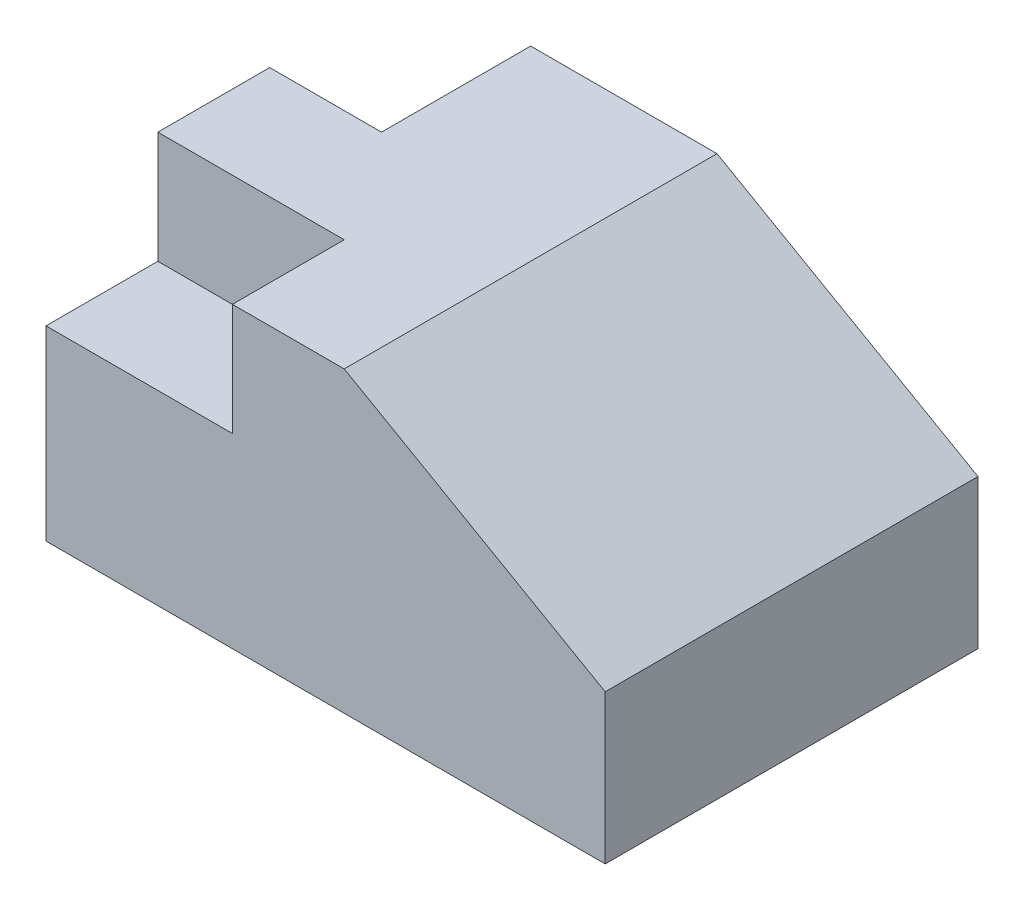
ISO-10303-21;
HEADER;
FILE_DESCRIPTION(('STEP AP214'),'2;1');
FILE_NAME('part.step','',(''),(''),'','','');
FILE_SCHEMA(('AUTOMOTIVE_DESIGN { 1 0 10303 214 1 1 1 1 }'));
ENDSEC;
DATA;
#1=APPLICATION_CONTEXT('core data for automotive mechanical design processes');
#2=APPLICATION_PROTOCOL_DEFINITION('international standard','automotive_design',2000,#1);
#3=PRODUCT_CONTEXT('',#1,'mechanical');
#4=PRODUCT('Part','Part','',(#3));
#5=PRODUCT_RELATED_PRODUCT_CATEGORY('part','',(#4));
#6=PRODUCT_DEFINITION_FORMATION('','',#4);
#7=PRODUCT_DEFINITION_CONTEXT('part definition',#1,'design');
#8=PRODUCT_DEFINITION('design','',#6,#7);
#9=PRODUCT_DEFINITION_SHAPE('','',#8);
#10=(LENGTH_UNIT() NAMED_UNIT(*) SI_UNIT(.MILLI.,.METRE.));
#11=(NAMED_UNIT(*) PLANE_ANGLE_UNIT() SI_UNIT($,.RADIAN.));
#12=(NAMED_UNIT(*) SI_UNIT($,.STERADIAN.) SOLID_ANGLE_UNIT());
#13=UNCERTAINTY_MEASURE_WITH_UNIT(LENGTH_MEASURE(1.E-05),#10,'distance_accuracy_value','');
#14=(GEOMETRIC_REPRESENTATION_CONTEXT(3) GLOBAL_UNCERTAINTY_ASSIGNED_CONTEXT((#13)) GLOBAL_UNIT_ASSIGNED_CONTEXT((#10,
#11,#12)) REPRESENTATION_CONTEXT('',''));
#15=CARTESIAN_POINT('',(0.,0.,0.));
#16=DIRECTION('',(0.,0.,1.));
#17=DIRECTION('',(1.,0.,0.));
#18=AXIS2_PLACEMENT_3D('',#15,#16,#17);
#19=CARTESIAN_POINT('',(75.,80.,50.));
#20=DIRECTION('',(-1.,0.,0.));
#21=DIRECTION('',(0.,0.,1.));
#22=AXIS2_PLACEMENT_3D('',#19,#20,#21);
#23=PLANE('',#22);
#24=DIRECTION('',(0.,-1.,0.));
#25=VECTOR('',#24,1.);
#26=CARTESIAN_POINT('',(75.,80.,-50.));
#27=LINE('',#26,#25);
#28=CARTESIAN_POINT('',(75.,40.,-50.));
#29=VERTEX_POINT('',#28);
#30=CARTESIAN_POINT('',(75.,0.,-50.));
#31=VERTEX_POINT('',#30);
#32=EDGE_CURVE('E11',#29,#31,#27,.T.);
#33=ORIENTED_EDGE('',*,*,#32,.F.);
#34=DIRECTION('',(0.,0.,1.));
#35=VECTOR('',#34,1.);
#36=CARTESIAN_POINT('',(75.,40.,-50.));
#37=LINE('',#36,#35);
#38=CARTESIAN_POINT('',(75.,40.,50.));
#39=VERTEX_POINT('',#38);
#40=EDGE_CURVE('E176',#29,#39,#37,.T.);
#41=ORIENTED_EDGE('',*,*,#40,.T.);
#42=DIRECTION('',(0.,-1.,0.));
#43=VECTOR('',#42,1.);
#44=CARTESIAN_POINT('',(75.,80.,50.));
#45=LINE('',#44,#43);
#46=CARTESIAN_POINT('',(75.,0.,50.));
#47=VERTEX_POINT('',#46);
#48=EDGE_CURVE('E155',#39,#47,#45,.T.);
#49=ORIENTED_EDGE('',*,*,#48,.T.);
#50=DIRECTION('',(0.,0.,-1.));
#51=VECTOR('',#50,1.);
#52=CARTESIAN_POINT('',(75.,0.,50.));
#53=LINE('',#52,#51);
#54=EDGE_CURVE('E172',#47,#31,#53,.T.);
#55=ORIENTED_EDGE('',*,*,#54,.T.);
#56=EDGE_LOOP('',(#33,#41,#49,#55));
#57=FACE_BOUND('',#56,.T.);
#58=ADVANCED_FACE('F43',(#57),#23,.F.);
#59=CARTESIAN_POINT('',(-75.,80.,-50.));
#60=DIRECTION('',(0.,0.,1.));
#61=DIRECTION('',(1.,0.,0.));
#62=AXIS2_PLACEMENT_3D('',#59,#60,#61);
#63=PLANE('',#62);
#64=DIRECTION('',(-1.,0.,0.));
#65=VECTOR('',#64,1.);
#66=CARTESIAN_POINT('',(-75.,50.,-50.));
#67=LINE('',#66,#65);
#68=CARTESIAN_POINT('',(-45.,50.,-50.));
#69=VERTEX_POINT('',#68);
#70=CARTESIAN_POINT('',(-75.,50.,-50.));
#71=VERTEX_POINT('',#70);
#72=EDGE_CURVE('E214',#69,#71,#67,.T.);
#73=ORIENTED_EDGE('',*,*,#72,.F.);
#74=DIRECTION('',(0.,1.,0.));
#75=VECTOR('',#74,1.);
#76=CARTESIAN_POINT('',(-45.,50.,-50.));
#77=LINE('',#76,#75);
#78=CARTESIAN_POINT('',(-45.,80.,-50.));
#79=VERTEX_POINT('',#78);
#80=EDGE_CURVE('E223',#69,#79,#77,.T.);
#81=ORIENTED_EDGE('',*,*,#80,.T.);
#82=DIRECTION('',(-1.,0.,0.));
#83=VECTOR('',#82,1.);
#84=CARTESIAN_POINT('',(-75.,80.,-50.));
#85=LINE('',#84,#83);
#86=CARTESIAN_POINT('',(4.99999999999999,80.,-50.));
#87=VERTEX_POINT('',#86);
#88=EDGE_CURVE('E165',#87,#79,#85,.T.);
#89=ORIENTED_EDGE('',*,*,#88,.F.);
#90=DIRECTION('',(0.868243142124459,-0.496138938356834,0.));
#91=VECTOR('',#90,1.);
#92=CARTESIAN_POINT('',(35.6923076923077,62.4615384615385,-50.));
#93=LINE('',#92,#91);
#94=EDGE_CURVE('E190',#87,#29,#93,.T.);
#95=ORIENTED_EDGE('',*,*,#94,.T.);
#96=ORIENTED_EDGE('',*,*,#32,.T.);
#97=DIRECTION('',(-1.,0.,0.));
#98=VECTOR('',#97,1.);
#99=CARTESIAN_POINT('',(-75.,0.,-50.));
#100=LINE('',#99,#98);
#101=CARTESIAN_POINT('',(-75.,0.,-50.));
#102=VERTEX_POINT('',#101);
#103=EDGE_CURVE('E168',#31,#102,#100,.T.);
#104=ORIENTED_EDGE('',*,*,#103,.T.);
#105=DIRECTION('',(0.,-1.,0.));
#106=VECTOR('',#105,1.);
#107=CARTESIAN_POINT('',(-75.,80.,-50.));
#108=LINE('',#107,#106);
#109=EDGE_CURVE('E51',#71,#102,#108,.T.);
#110=ORIENTED_EDGE('',*,*,#109,.F.);
#111=EDGE_LOOP('',(#73,#81,#89,#95,#96,#104,#110));
#112=FACE_BOUND('',#111,.T.);
#113=ADVANCED_FACE('F263',(#112),#63,.F.);
#114=CARTESIAN_POINT('',(-75.,80.,50.));
#115=DIRECTION('',(1.,0.,0.));
#116=DIRECTION('',(0.,0.,-1.));
#117=AXIS2_PLACEMENT_3D('',#114,#115,#116);
#118=PLANE('',#117);
#119=DIRECTION('',(0.,0.,1.));
#120=VECTOR('',#119,1.);
#121=CARTESIAN_POINT('',(-75.,50.,50.));
#122=LINE('',#121,#120);
#123=CARTESIAN_POINT('',(-75.,50.,20.));
#124=VERTEX_POINT('',#123);
#125=CARTESIAN_POINT('',(-75.,50.,50.));
#126=VERTEX_POINT('',#125);
#127=EDGE_CURVE('E128',#124,#126,#122,.T.);
#128=ORIENTED_EDGE('',*,*,#127,.F.);
#129=DIRECTION('',(0.,1.,0.));
#130=VECTOR('',#129,1.);
#131=CARTESIAN_POINT('',(-75.,50.,20.));
#132=LINE('',#131,#130);
#133=CARTESIAN_POINT('',(-75.,80.,20.));
#134=VERTEX_POINT('',#133);
#135=EDGE_CURVE('E197',#124,#134,#132,.T.);
#136=ORIENTED_EDGE('',*,*,#135,.T.);
#137=DIRECTION('',(0.,0.,1.));
#138=VECTOR('',#137,1.);
#139=CARTESIAN_POINT('',(-75.,80.,50.));
#140=LINE('',#139,#138);
#141=CARTESIAN_POINT('',(-75.,80.,-10.));
#142=VERTEX_POINT('',#141);
#143=EDGE_CURVE('E179',#142,#134,#140,.T.);
#144=ORIENTED_EDGE('',*,*,#143,.F.);
#145=DIRECTION('',(0.,1.,0.));
#146=VECTOR('',#145,1.);
#147=CARTESIAN_POINT('',(-75.,50.,-10.));
#148=LINE('',#147,#146);
#149=CARTESIAN_POINT('',(-75.,50.,-10.));
#150=VERTEX_POINT('',#149);
#151=EDGE_CURVE('E58',#150,#142,#148,.T.);
#152=ORIENTED_EDGE('',*,*,#151,.F.);
#153=DIRECTION('',(0.,0.,1.));
#154=VECTOR('',#153,1.);
#155=CARTESIAN_POINT('',(-75.,50.,-50.));
#156=LINE('',#155,#154);
#157=EDGE_CURVE('E201',#71,#150,#156,.T.);
#158=ORIENTED_EDGE('',*,*,#157,.F.);
#159=ORIENTED_EDGE('',*,*,#109,.T.);
#160=DIRECTION('',(0.,0.,1.));
#161=VECTOR('',#160,1.);
#162=CARTESIAN_POINT('',(-75.,0.,50.));
#163=LINE('',#162,#161);
#164=CARTESIAN_POINT('',(-75.,0.,50.));
#165=VERTEX_POINT('',#164);
#166=EDGE_CURVE('E152',#102,#165,#163,.T.);
#167=ORIENTED_EDGE('',*,*,#166,.T.);
#168=DIRECTION('',(0.,-1.,0.));
#169=VECTOR('',#168,1.);
#170=CARTESIAN_POINT('',(-75.,80.,50.));
#171=LINE('',#170,#169);
#172=EDGE_CURVE('E145',#126,#165,#171,.T.);
#173=ORIENTED_EDGE('',*,*,#172,.F.);
#174=EDGE_LOOP('',(#128,#136,#144,#152,#158,#159,#167,#173));
#175=FACE_BOUND('',#174,.T.);
#176=ADVANCED_FACE('F150',(#175),#118,.F.);
#177=CARTESIAN_POINT('',(-75.,80.,50.));
#178=DIRECTION('',(0.,0.,-1.));
#179=DIRECTION('',(-1.,0.,0.));
#180=AXIS2_PLACEMENT_3D('',#177,#178,#179);
#181=PLANE('',#180);
#182=DIRECTION('',(1.,0.,0.));
#183=VECTOR('',#182,1.);
#184=CARTESIAN_POINT('',(-75.,80.,50.));
#185=LINE('',#184,#183);
#186=CARTESIAN_POINT('',(-25.,80.,50.));
#187=VERTEX_POINT('',#186);
#188=CARTESIAN_POINT('',(5.,80.,50.));
#189=VERTEX_POINT('',#188);
#190=EDGE_CURVE('E159',#187,#189,#185,.T.);
#191=ORIENTED_EDGE('',*,*,#190,.F.);
#192=DIRECTION('',(0.,1.,0.));
#193=VECTOR('',#192,1.);
#194=CARTESIAN_POINT('',(-25.,50.,50.));
#195=LINE('',#194,#193);
#196=CARTESIAN_POINT('',(-25.,50.,50.));
#197=VERTEX_POINT('',#196);
#198=EDGE_CURVE('E66',#197,#187,#195,.T.);
#199=ORIENTED_EDGE('',*,*,#198,.F.);
#200=DIRECTION('',(1.,0.,0.));
#201=VECTOR('',#200,1.);
#202=CARTESIAN_POINT('',(-75.,50.,50.));
#203=LINE('',#202,#201);
#204=EDGE_CURVE('E132',#126,#197,#203,.T.);
#205=ORIENTED_EDGE('',*,*,#204,.F.);
#206=ORIENTED_EDGE('',*,*,#172,.T.);
#207=DIRECTION('',(1.,0.,0.));
#208=VECTOR('',#207,1.);
#209=CARTESIAN_POINT('',(-75.,0.,50.));
#210=LINE('',#209,#208);
#211=EDGE_CURVE('E162',#165,#47,#210,.T.);
#212=ORIENTED_EDGE('',*,*,#211,.T.);
#213=ORIENTED_EDGE('',*,*,#48,.F.);
#214=DIRECTION('',(0.868243142124459,-0.496138938356834,0.));
#215=VECTOR('',#214,1.);
#216=CARTESIAN_POINT('',(35.6923076923077,62.4615384615385,50.));
#217=LINE('',#216,#215);
#218=EDGE_CURVE('E194',#189,#39,#217,.T.);
#219=ORIENTED_EDGE('',*,*,#218,.F.);
#220=EDGE_LOOP('',(#191,#199,#205,#206,#212,#213,#219));
#221=FACE_BOUND('',#220,.T.);
#222=ADVANCED_FACE('F143',(#221),#181,.F.);
#223=CARTESIAN_POINT('',(0.,80.,0.));
#224=DIRECTION('',(0.,-1.,0.));
#225=DIRECTION('',(0.,0.,-1.));
#226=AXIS2_PLACEMENT_3D('',#223,#224,#225);
#227=PLANE('',#226);
#228=ORIENTED_EDGE('',*,*,#143,.T.);
#229=DIRECTION('',(-1.,0.,0.));
#230=VECTOR('',#229,1.);
#231=CARTESIAN_POINT('',(-75.,80.,20.));
#232=LINE('',#231,#230);
#233=CARTESIAN_POINT('',(-25.,80.,20.));
#234=VERTEX_POINT('',#233);
#235=EDGE_CURVE('E139',#234,#134,#232,.T.);
#236=ORIENTED_EDGE('',*,*,#235,.F.);
#237=DIRECTION('',(0.,0.,-1.));
#238=VECTOR('',#237,1.);
#239=CARTESIAN_POINT('',(-25.,80.,50.));
#240=LINE('',#239,#238);
#241=EDGE_CURVE('E220',#187,#234,#240,.T.);
#242=ORIENTED_EDGE('',*,*,#241,.F.);
#243=ORIENTED_EDGE('',*,*,#190,.T.);
#244=DIRECTION('',(0.,0.,1.));
#245=VECTOR('',#244,1.);
#246=CARTESIAN_POINT('',(5.,80.,-50.));
#247=LINE('',#246,#245);
#248=EDGE_CURVE('E186',#87,#189,#247,.T.);
#249=ORIENTED_EDGE('',*,*,#248,.F.);
#250=ORIENTED_EDGE('',*,*,#88,.T.);
#251=DIRECTION('',(0.,0.,-1.));
#252=VECTOR('',#251,1.);
#253=CARTESIAN_POINT('',(-45.,80.,-50.));
#254=LINE('',#253,#252);
#255=CARTESIAN_POINT('',(-45.,80.,-10.));
#256=VERTEX_POINT('',#255);
#257=EDGE_CURVE('E205',#256,#79,#254,.T.);
#258=ORIENTED_EDGE('',*,*,#257,.F.);
#259=DIRECTION('',(1.,0.,0.));
#260=VECTOR('',#259,1.);
#261=CARTESIAN_POINT('',(-75.,80.,-10.));
#262=LINE('',#261,#260);
#263=EDGE_CURVE('E217',#142,#256,#262,.T.);
#264=ORIENTED_EDGE('',*,*,#263,.F.);
#265=EDGE_LOOP('',(#228,#236,#242,#243,#249,#250,#258,#264));
#266=FACE_BOUND('',#265,.T.);
#267=ADVANCED_FACE('F251',(#266),#227,.F.);
#268=CARTESIAN_POINT('',(0.,0.,0.));
#269=DIRECTION('',(0.,-1.,0.));
#270=DIRECTION('',(0.,0.,-1.));
#271=AXIS2_PLACEMENT_3D('',#268,#269,#270);
#272=PLANE('',#271);
#273=ORIENTED_EDGE('',*,*,#54,.F.);
#274=ORIENTED_EDGE('',*,*,#211,.F.);
#275=ORIENTED_EDGE('',*,*,#166,.F.);
#276=ORIENTED_EDGE('',*,*,#103,.F.);
#277=EDGE_LOOP('',(#273,#274,#275,#276));
#278=FACE_BOUND('',#277,.T.);
#279=ADVANCED_FACE('F268',(#278),#272,.T.);
#280=CARTESIAN_POINT('',(35.6923076923077,62.4615384615385,-50.));
#281=DIRECTION('',(-0.496138938356834,-0.868243142124459,0.));
#282=DIRECTION('',(0.868243142124459,-0.496138938356834,0.));
#283=AXIS2_PLACEMENT_3D('',#280,#281,#282);
#284=PLANE('',#283);
#285=ORIENTED_EDGE('',*,*,#218,.T.);
#286=ORIENTED_EDGE('',*,*,#40,.F.);
#287=ORIENTED_EDGE('',*,*,#94,.F.);
#288=ORIENTED_EDGE('',*,*,#248,.T.);
#289=EDGE_LOOP('',(#285,#286,#287,#288));
#290=FACE_BOUND('',#289,.T.);
#291=ADVANCED_FACE('F273',(#290),#284,.F.);
#292=CARTESIAN_POINT('',(-45.,50.,-50.));
#293=DIRECTION('',(1.,0.,0.));
#294=DIRECTION('',(0.,0.,-1.));
#295=AXIS2_PLACEMENT_3D('',#292,#293,#294);
#296=PLANE('',#295);
#297=ORIENTED_EDGE('',*,*,#257,.T.);
#298=ORIENTED_EDGE('',*,*,#80,.F.);
#299=DIRECTION('',(0.,0.,-1.));
#300=VECTOR('',#299,1.);
#301=CARTESIAN_POINT('',(-45.,50.,-50.));
#302=LINE('',#301,#300);
#303=CARTESIAN_POINT('',(-45.,50.,-10.));
#304=VERTEX_POINT('',#303);
#305=EDGE_CURVE('E210',#304,#69,#302,.T.);
#306=ORIENTED_EDGE('',*,*,#305,.F.);
#307=DIRECTION('',(0.,1.,0.));
#308=VECTOR('',#307,1.);
#309=CARTESIAN_POINT('',(-45.,50.,-10.));
#310=LINE('',#309,#308);
#311=EDGE_CURVE('E227',#304,#256,#310,.T.);
#312=ORIENTED_EDGE('',*,*,#311,.T.);
#313=EDGE_LOOP('',(#297,#298,#306,#312));
#314=FACE_BOUND('',#313,.T.);
#315=ADVANCED_FACE('F256',(#314),#296,.F.);
#316=CARTESIAN_POINT('',(-75.,50.,-10.));
#317=DIRECTION('',(0.,0.,1.));
#318=DIRECTION('',(1.,0.,0.));
#319=AXIS2_PLACEMENT_3D('',#316,#317,#318);
#320=PLANE('',#319);
#321=ORIENTED_EDGE('',*,*,#263,.T.);
#322=ORIENTED_EDGE('',*,*,#311,.F.);
#323=DIRECTION('',(1.,0.,0.));
#324=VECTOR('',#323,1.);
#325=CARTESIAN_POINT('',(-75.,50.,-10.));
#326=LINE('',#325,#324);
#327=EDGE_CURVE('E206',#150,#304,#326,.T.);
#328=ORIENTED_EDGE('',*,*,#327,.F.);
#329=ORIENTED_EDGE('',*,*,#151,.T.);
#330=EDGE_LOOP('',(#321,#322,#328,#329));
#331=FACE_BOUND('',#330,.T.);
#332=ADVANCED_FACE('F253',(#331),#320,.F.);
#333=CARTESIAN_POINT('',(0.,50.,0.));
#334=DIRECTION('',(0.,1.,0.));
#335=DIRECTION('',(0.,0.,1.));
#336=AXIS2_PLACEMENT_3D('',#333,#334,#335);
#337=PLANE('',#336);
#338=ORIENTED_EDGE('',*,*,#157,.T.);
#339=ORIENTED_EDGE('',*,*,#327,.T.);
#340=ORIENTED_EDGE('',*,*,#305,.T.);
#341=ORIENTED_EDGE('',*,*,#72,.T.);
#342=EDGE_LOOP('',(#338,#339,#340,#341));
#343=FACE_BOUND('',#342,.T.);
#344=ADVANCED_FACE('F259',(#343),#337,.T.);
#345=CARTESIAN_POINT('',(-75.,50.,20.));
#346=DIRECTION('',(0.,0.,-1.));
#347=DIRECTION('',(-1.,0.,0.));
#348=AXIS2_PLACEMENT_3D('',#345,#346,#347);
#349=PLANE('',#348);
#350=ORIENTED_EDGE('',*,*,#235,.T.);
#351=ORIENTED_EDGE('',*,*,#135,.F.);
#352=DIRECTION('',(-1.,0.,0.));
#353=VECTOR('',#352,1.);
#354=CARTESIAN_POINT('',(-75.,50.,20.));
#355=LINE('',#354,#353);
#356=CARTESIAN_POINT('',(-25.,50.,20.));
#357=VERTEX_POINT('',#356);
#358=EDGE_CURVE('E134',#357,#124,#355,.T.);
#359=ORIENTED_EDGE('',*,*,#358,.F.);
#360=DIRECTION('',(0.,1.,0.));
#361=VECTOR('',#360,1.);
#362=CARTESIAN_POINT('',(-25.,50.,20.));
#363=LINE('',#362,#361);
#364=EDGE_CURVE('E234',#357,#234,#363,.T.);
#365=ORIENTED_EDGE('',*,*,#364,.T.);
#366=EDGE_LOOP('',(#350,#351,#359,#365));
#367=FACE_BOUND('',#366,.T.);
#368=ADVANCED_FACE('F247',(#367),#349,.F.);
#369=CARTESIAN_POINT('',(-25.,50.,50.));
#370=DIRECTION('',(1.,0.,0.));
#371=DIRECTION('',(0.,0.,-1.));
#372=AXIS2_PLACEMENT_3D('',#369,#370,#371);
#373=PLANE('',#372);
#374=ORIENTED_EDGE('',*,*,#241,.T.);
#375=ORIENTED_EDGE('',*,*,#364,.F.);
#376=DIRECTION('',(0.,0.,-1.));
#377=VECTOR('',#376,1.);
#378=CARTESIAN_POINT('',(-25.,50.,50.));
#379=LINE('',#378,#377);
#380=EDGE_CURVE('E148',#197,#357,#379,.T.);
#381=ORIENTED_EDGE('',*,*,#380,.F.);
#382=ORIENTED_EDGE('',*,*,#198,.T.);
#383=EDGE_LOOP('',(#374,#375,#381,#382));
#384=FACE_BOUND('',#383,.T.);
#385=ADVANCED_FACE('F276',(#384),#373,.F.);
#386=CARTESIAN_POINT('',(0.,50.,0.));
#387=DIRECTION('',(0.,-1.,0.));
#388=DIRECTION('',(0.,0.,-1.));
#389=AXIS2_PLACEMENT_3D('',#386,#387,#388);
#390=PLANE('',#389);
#391=ORIENTED_EDGE('',*,*,#127,.T.);
#392=ORIENTED_EDGE('',*,*,#204,.T.);
#393=ORIENTED_EDGE('',*,*,#380,.T.);
#394=ORIENTED_EDGE('',*,*,#358,.T.);
#395=EDGE_LOOP('',(#391,#392,#393,#394));
#396=FACE_BOUND('',#395,.T.);
#397=ADVANCED_FACE('F130',(#396),#390,.F.);
#398=CLOSED_SHELL('',(#58,#113,#176,#222,#267,#279,#291,#315,#332,#344,#368,#385,#397));
#399=MANIFOLD_SOLID_BREP('B2',#398);
#400=ADVANCED_BREP_SHAPE_REPRESENTATION('',(#18,#399),#14);
#401=SHAPE_DEFINITION_REPRESENTATION(#9,#400);
ENDSEC;
END-ISO-10303-21;
